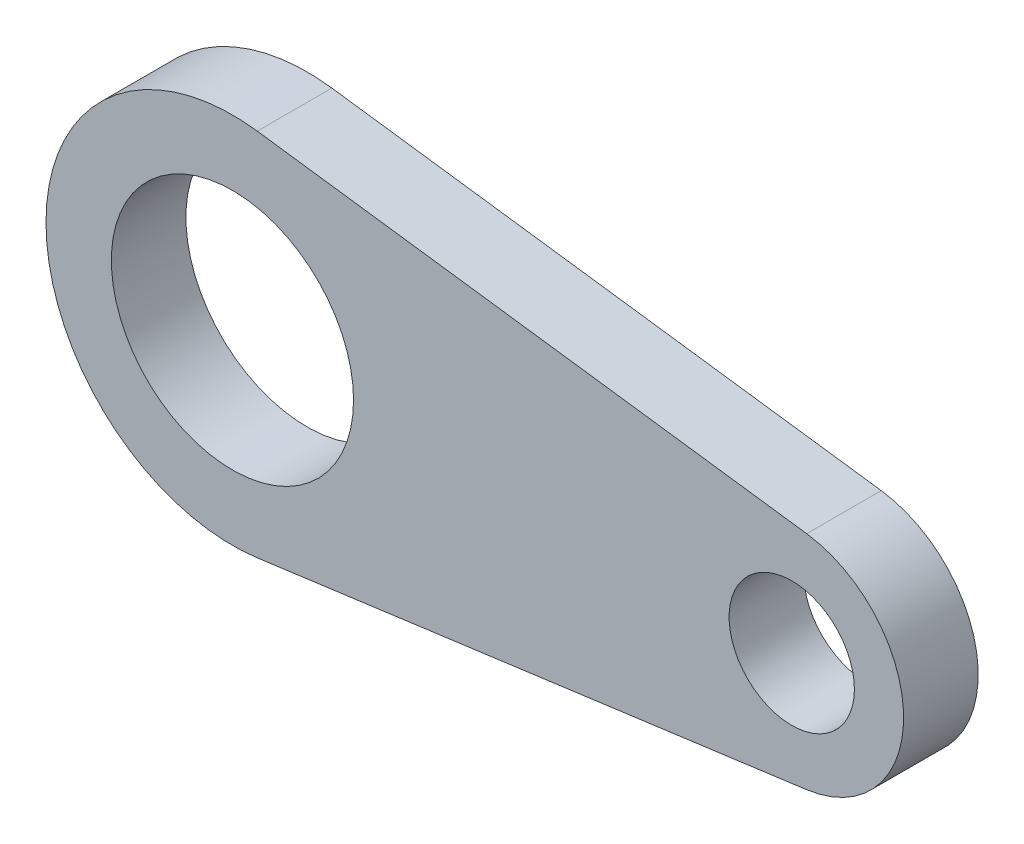
ISO-10303-21;
HEADER;
FILE_DESCRIPTION(('STEP AP214'),'2;1');
FILE_NAME('part.step','',(''),(''),'','','');
FILE_SCHEMA(('AUTOMOTIVE_DESIGN { 1 0 10303 214 1 1 1 1 }'));
ENDSEC;
DATA;
#1=APPLICATION_CONTEXT('core data for automotive mechanical design processes');
#2=APPLICATION_PROTOCOL_DEFINITION('international standard','automotive_design',2000,#1);
#3=PRODUCT_CONTEXT('',#1,'mechanical');
#4=PRODUCT('Part','Part','',(#3));
#5=PRODUCT_RELATED_PRODUCT_CATEGORY('part','',(#4));
#6=PRODUCT_DEFINITION_FORMATION('','',#4);
#7=PRODUCT_DEFINITION_CONTEXT('part definition',#1,'design');
#8=PRODUCT_DEFINITION('design','',#6,#7);
#9=PRODUCT_DEFINITION_SHAPE('','',#8);
#10=(LENGTH_UNIT() NAMED_UNIT(*) SI_UNIT(.MILLI.,.METRE.));
#11=(NAMED_UNIT(*) PLANE_ANGLE_UNIT() SI_UNIT($,.RADIAN.));
#12=(NAMED_UNIT(*) SI_UNIT($,.STERADIAN.) SOLID_ANGLE_UNIT());
#13=UNCERTAINTY_MEASURE_WITH_UNIT(LENGTH_MEASURE(1.E-05),#10,'distance_accuracy_value','');
#14=(GEOMETRIC_REPRESENTATION_CONTEXT(3) GLOBAL_UNCERTAINTY_ASSIGNED_CONTEXT((#13)) GLOBAL_UNIT_ASSIGNED_CONTEXT((#10,
#11,#12)) REPRESENTATION_CONTEXT('',''));
#15=CARTESIAN_POINT('',(0.,0.,0.));
#16=DIRECTION('',(0.,0.,1.));
#17=DIRECTION('',(1.,0.,0.));
#18=AXIS2_PLACEMENT_3D('',#15,#16,#17);
#19=CARTESIAN_POINT('',(-4.05707091704882,5.35865166961025,0.));
#20=DIRECTION('',(0.,0.,1.));
#21=DIRECTION('',(1.,0.,0.));
#22=AXIS2_PLACEMENT_3D('',#19,#20,#21);
#23=PLANE('',#22);
#24=CARTESIAN_POINT('',(9.98325015582036,5.35865166961025,0.));
#25=DIRECTION('',(0.,0.,1.));
#26=DIRECTION('',(1.,0.,0.));
#27=AXIS2_PLACEMENT_3D('',#24,#25,#26);
#28=CIRCLE('',#27,4.7625);
#29=CARTESIAN_POINT('',(10.6182501558204,0.638674842336628,0.));
#30=VERTEX_POINT('',#29);
#31=CARTESIAN_POINT('',(10.6182501558204,10.0786284968839,0.));
#32=VERTEX_POINT('',#31);
#33=EDGE_CURVE('E56',#30,#32,#28,.T.);
#34=ORIENTED_EDGE('',*,*,#33,.F.);
#35=DIRECTION('',(0.991071249821234,0.133333333333333,0.));
#36=VECTOR('',#35,1.);
#37=CARTESIAN_POINT('',(10.6182501558204,0.638674842336628,0.));
#38=LINE('',#37,#36);
#39=CARTESIAN_POINT('',(-12.7709165108463,-2.50797637584578,0.));
#40=VERTEX_POINT('',#39);
#41=EDGE_CURVE('E61',#40,#30,#38,.T.);
#42=ORIENTED_EDGE('',*,*,#41,.F.);
#43=CARTESIAN_POINT('',(-13.8292498441796,5.35865166961025,0.));
#44=DIRECTION('',(0.,0.,1.));
#45=DIRECTION('',(1.,0.,0.));
#46=AXIS2_PLACEMENT_3D('',#43,#44,#45);
#47=CIRCLE('',#46,7.9375);
#48=CARTESIAN_POINT('',(-12.7709165108463,13.2252797150663,0.));
#49=VERTEX_POINT('',#48);
#50=EDGE_CURVE('E78',#49,#40,#47,.T.);
#51=ORIENTED_EDGE('',*,*,#50,.F.);
#52=DIRECTION('',(-0.991071249821234,0.133333333333333,0.));
#53=VECTOR('',#52,1.);
#54=CARTESIAN_POINT('',(-12.7709165108463,13.2252797150663,0.));
#55=LINE('',#54,#53);
#56=EDGE_CURVE('E62',#32,#49,#55,.T.);
#57=ORIENTED_EDGE('',*,*,#56,.F.);
#58=EDGE_LOOP('',(#34,#42,#51,#57));
#59=FACE_BOUND('',#58,.T.);
#60=CARTESIAN_POINT('',(9.98325015582036,5.35865166961025,0.));
#61=DIRECTION('',(0.,0.,1.));
#62=DIRECTION('',(1.,0.,0.));
#63=AXIS2_PLACEMENT_3D('',#60,#61,#62);
#64=CIRCLE('',#63,2.667);
#65=CARTESIAN_POINT('',(12.6502501558204,5.35865166961025,0.));
#66=VERTEX_POINT('',#65);
#67=EDGE_CURVE('E66',#66,#66,#64,.T.);
#68=ORIENTED_EDGE('',*,*,#67,.T.);
#69=EDGE_LOOP('',(#68));
#70=FACE_BOUND('',#69,.T.);
#71=CARTESIAN_POINT('',(-13.8292498441796,5.35865166961025,0.));
#72=DIRECTION('',(0.,0.,1.));
#73=DIRECTION('',(1.,0.,0.));
#74=AXIS2_PLACEMENT_3D('',#71,#72,#73);
#75=CIRCLE('',#74,5.1562);
#76=CARTESIAN_POINT('',(-8.67304984417964,5.35865166961025,0.));
#77=VERTEX_POINT('',#76);
#78=EDGE_CURVE('E20',#77,#77,#75,.T.);
#79=ORIENTED_EDGE('',*,*,#78,.T.);
#80=EDGE_LOOP('',(#79));
#81=FACE_BOUND('',#80,.T.);
#82=ADVANCED_FACE('F17',(#59,#70,#81),#23,.F.);
#83=CARTESIAN_POINT('',(-13.8292498441796,5.35865166961025,0.));
#84=DIRECTION('',(0.,0.,1.));
#85=DIRECTION('',(1.,0.,0.));
#86=AXIS2_PLACEMENT_3D('',#83,#84,#85);
#87=CYLINDRICAL_SURFACE('',#86,5.1562);
#88=ORIENTED_EDGE('',*,*,#78,.F.);
#89=EDGE_LOOP('',(#88));
#90=FACE_BOUND('',#89,.T.);
#91=CARTESIAN_POINT('',(-13.8292498441796,5.35865166961025,3.175));
#92=DIRECTION('',(0.,0.,1.));
#93=DIRECTION('',(1.,0.,0.));
#94=AXIS2_PLACEMENT_3D('',#91,#92,#93);
#95=CIRCLE('',#94,5.1562);
#96=CARTESIAN_POINT('',(-8.67304984417964,5.35865166961025,3.175));
#97=VERTEX_POINT('',#96);
#98=EDGE_CURVE('E74',#97,#97,#95,.F.);
#99=ORIENTED_EDGE('',*,*,#98,.F.);
#100=EDGE_LOOP('',(#99));
#101=FACE_BOUND('',#100,.T.);
#102=ADVANCED_FACE('F100',(#90,#101),#87,.F.);
#103=CARTESIAN_POINT('',(9.98325015582036,5.35865166961025,0.));
#104=DIRECTION('',(0.,0.,1.));
#105=DIRECTION('',(1.,0.,0.));
#106=AXIS2_PLACEMENT_3D('',#103,#104,#105);
#107=CYLINDRICAL_SURFACE('',#106,2.667);
#108=ORIENTED_EDGE('',*,*,#67,.F.);
#109=EDGE_LOOP('',(#108));
#110=FACE_BOUND('',#109,.T.);
#111=CARTESIAN_POINT('',(9.98325015582036,5.35865166961025,3.175));
#112=DIRECTION('',(0.,0.,1.));
#113=DIRECTION('',(1.,0.,0.));
#114=AXIS2_PLACEMENT_3D('',#111,#112,#113);
#115=CIRCLE('',#114,2.667);
#116=CARTESIAN_POINT('',(12.6502501558204,5.35865166961025,3.175));
#117=VERTEX_POINT('',#116);
#118=EDGE_CURVE('E89',#117,#117,#115,.F.);
#119=ORIENTED_EDGE('',*,*,#118,.F.);
#120=EDGE_LOOP('',(#119));
#121=FACE_BOUND('',#120,.T.);
#122=ADVANCED_FACE('F103',(#110,#121),#107,.F.);
#123=CARTESIAN_POINT('',(9.98325015582036,5.35865166961025,0.));
#124=DIRECTION('',(0.,0.,1.));
#125=DIRECTION('',(1.,0.,0.));
#126=AXIS2_PLACEMENT_3D('',#123,#124,#125);
#127=CYLINDRICAL_SURFACE('',#126,4.7625);
#128=ORIENTED_EDGE('',*,*,#33,.T.);
#129=DIRECTION('',(0.,0.,1.));
#130=VECTOR('',#129,1.);
#131=CARTESIAN_POINT('',(10.6182501558204,10.0786284968839,0.));
#132=LINE('',#131,#130);
#133=CARTESIAN_POINT('',(10.6182501558204,10.0786284968839,3.175));
#134=VERTEX_POINT('',#133);
#135=EDGE_CURVE('E65',#134,#32,#132,.F.);
#136=ORIENTED_EDGE('',*,*,#135,.F.);
#137=CARTESIAN_POINT('',(9.98325015582036,5.35865166961025,3.175));
#138=DIRECTION('',(0.,0.,1.));
#139=DIRECTION('',(1.,0.,0.));
#140=AXIS2_PLACEMENT_3D('',#137,#138,#139);
#141=CIRCLE('',#140,4.7625);
#142=CARTESIAN_POINT('',(10.6182501558204,0.638674842336628,3.175));
#143=VERTEX_POINT('',#142);
#144=EDGE_CURVE('E72',#143,#134,#141,.T.);
#145=ORIENTED_EDGE('',*,*,#144,.F.);
#146=DIRECTION('',(0.,0.,1.));
#147=VECTOR('',#146,1.);
#148=CARTESIAN_POINT('',(10.6182501558204,0.638674842336628,0.));
#149=LINE('',#148,#147);
#150=EDGE_CURVE('E69',#30,#143,#149,.T.);
#151=ORIENTED_EDGE('',*,*,#150,.F.);
#152=EDGE_LOOP('',(#128,#136,#145,#151));
#153=FACE_BOUND('',#152,.T.);
#154=ADVANCED_FACE('F70',(#153),#127,.T.);
#155=CARTESIAN_POINT('',(-12.7709165108463,13.2252797150663,0.));
#156=DIRECTION('',(0.133333333333333,0.991071249821234,0.));
#157=DIRECTION('',(-0.991071249821234,0.133333333333333,0.));
#158=AXIS2_PLACEMENT_3D('',#155,#156,#157);
#159=PLANE('',#158);
#160=ORIENTED_EDGE('',*,*,#56,.T.);
#161=DIRECTION('',(0.,0.,1.));
#162=VECTOR('',#161,1.);
#163=CARTESIAN_POINT('',(-12.7709165108463,13.2252797150663,0.));
#164=LINE('',#163,#162);
#165=CARTESIAN_POINT('',(-12.7709165108463,13.2252797150663,3.175));
#166=VERTEX_POINT('',#165);
#167=EDGE_CURVE('E84',#166,#49,#164,.F.);
#168=ORIENTED_EDGE('',*,*,#167,.F.);
#169=DIRECTION('',(-0.991071249821234,0.133333333333334,0.));
#170=VECTOR('',#169,1.);
#171=CARTESIAN_POINT('',(10.6182501558204,10.0786284968839,3.175));
#172=LINE('',#171,#170);
#173=EDGE_CURVE('E87',#134,#166,#172,.T.);
#174=ORIENTED_EDGE('',*,*,#173,.F.);
#175=ORIENTED_EDGE('',*,*,#135,.T.);
#176=EDGE_LOOP('',(#160,#168,#174,#175));
#177=FACE_BOUND('',#176,.T.);
#178=ADVANCED_FACE('F120',(#177),#159,.T.);
#179=CARTESIAN_POINT('',(-13.8292498441796,5.35865166961025,0.));
#180=DIRECTION('',(0.,0.,1.));
#181=DIRECTION('',(1.,0.,0.));
#182=AXIS2_PLACEMENT_3D('',#179,#180,#181);
#183=CYLINDRICAL_SURFACE('',#182,7.9375);
#184=ORIENTED_EDGE('',*,*,#50,.T.);
#185=DIRECTION('',(0.,0.,1.));
#186=VECTOR('',#185,1.);
#187=CARTESIAN_POINT('',(-12.7709165108463,-2.50797637584578,0.));
#188=LINE('',#187,#186);
#189=CARTESIAN_POINT('',(-12.7709165108463,-2.50797637584578,3.175));
#190=VERTEX_POINT('',#189);
#191=EDGE_CURVE('E35',#190,#40,#188,.F.);
#192=ORIENTED_EDGE('',*,*,#191,.F.);
#193=CARTESIAN_POINT('',(-13.8292498441796,5.35865166961025,3.175));
#194=DIRECTION('',(0.,0.,1.));
#195=DIRECTION('',(1.,0.,0.));
#196=AXIS2_PLACEMENT_3D('',#193,#194,#195);
#197=CIRCLE('',#196,7.9375);
#198=EDGE_CURVE('E26',#166,#190,#197,.T.);
#199=ORIENTED_EDGE('',*,*,#198,.F.);
#200=ORIENTED_EDGE('',*,*,#167,.T.);
#201=EDGE_LOOP('',(#184,#192,#199,#200));
#202=FACE_BOUND('',#201,.T.);
#203=ADVANCED_FACE('F114',(#202),#183,.T.);
#204=CARTESIAN_POINT('',(10.6182501558204,0.638674842336628,0.));
#205=DIRECTION('',(0.133333333333333,-0.991071249821234,0.));
#206=DIRECTION('',(0.991071249821234,0.133333333333333,0.));
#207=AXIS2_PLACEMENT_3D('',#204,#205,#206);
#208=PLANE('',#207);
#209=ORIENTED_EDGE('',*,*,#41,.T.);
#210=ORIENTED_EDGE('',*,*,#150,.T.);
#211=DIRECTION('',(0.991071249821234,0.133333333333333,0.));
#212=VECTOR('',#211,1.);
#213=CARTESIAN_POINT('',(-12.7709165108463,-2.50797637584579,3.175));
#214=LINE('',#213,#212);
#215=EDGE_CURVE('E11',#190,#143,#214,.T.);
#216=ORIENTED_EDGE('',*,*,#215,.F.);
#217=ORIENTED_EDGE('',*,*,#191,.T.);
#218=EDGE_LOOP('',(#209,#210,#216,#217));
#219=FACE_BOUND('',#218,.T.);
#220=ADVANCED_FACE('F76',(#219),#208,.T.);
#221=CARTESIAN_POINT('',(-4.05707091704882,5.35865166961025,3.175));
#222=DIRECTION('',(0.,0.,1.));
#223=DIRECTION('',(1.,0.,0.));
#224=AXIS2_PLACEMENT_3D('',#221,#222,#223);
#225=PLANE('',#224);
#226=ORIENTED_EDGE('',*,*,#198,.T.);
#227=ORIENTED_EDGE('',*,*,#215,.T.);
#228=ORIENTED_EDGE('',*,*,#144,.T.);
#229=ORIENTED_EDGE('',*,*,#173,.T.);
#230=EDGE_LOOP('',(#226,#227,#228,#229));
#231=FACE_BOUND('',#230,.T.);
#232=ORIENTED_EDGE('',*,*,#118,.T.);
#233=EDGE_LOOP('',(#232));
#234=FACE_BOUND('',#233,.T.);
#235=ORIENTED_EDGE('',*,*,#98,.T.);
#236=EDGE_LOOP('',(#235));
#237=FACE_BOUND('',#236,.T.);
#238=ADVANCED_FACE('F106',(#231,#234,#237),#225,.T.);
#239=CLOSED_SHELL('',(#82,#102,#122,#154,#178,#203,#220,#238));
#240=MANIFOLD_SOLID_BREP('B1',#239);
#241=ADVANCED_BREP_SHAPE_REPRESENTATION('',(#18,#240),#14);
#242=SHAPE_DEFINITION_REPRESENTATION(#9,#241);
ENDSEC;
END-ISO-10303-21;
